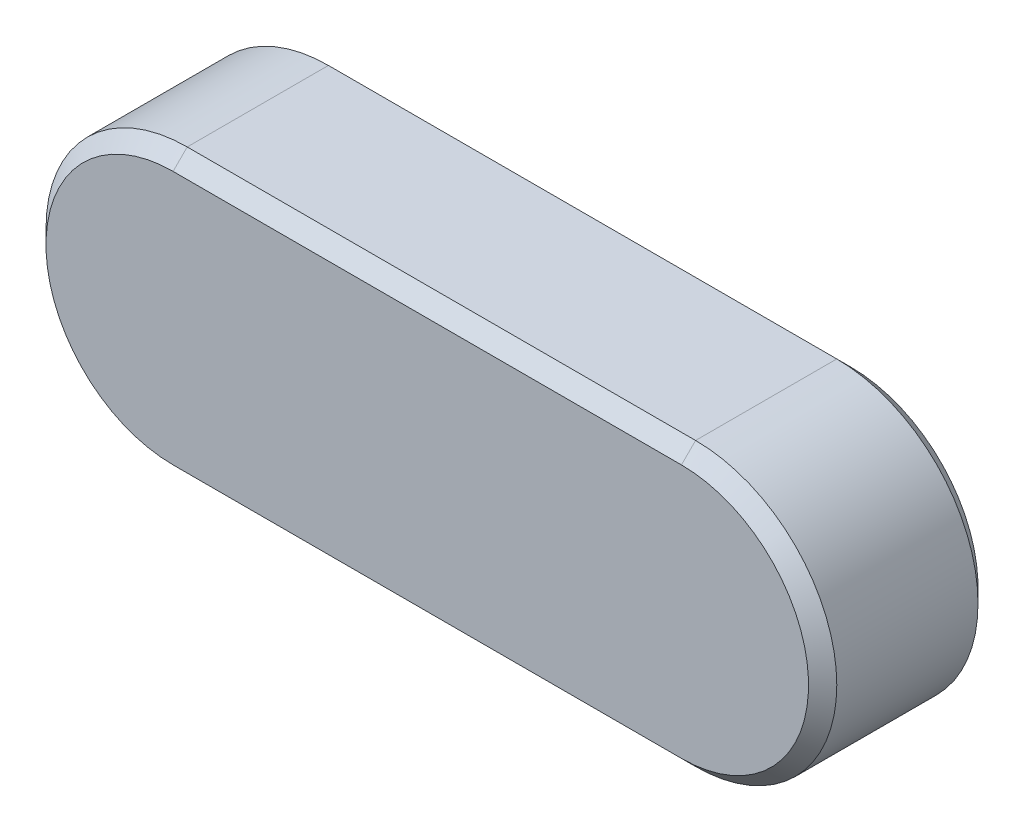
ISO-10303-21;
HEADER;
FILE_DESCRIPTION(('STEP AP214'),'2;1');
FILE_NAME('part.step','',(''),(''),'','','');
FILE_SCHEMA(('AUTOMOTIVE_DESIGN { 1 0 10303 214 1 1 1 1 }'));
ENDSEC;
DATA;
#1=APPLICATION_CONTEXT('core data for automotive mechanical design processes');
#2=APPLICATION_PROTOCOL_DEFINITION('international standard','automotive_design',2000,#1);
#3=PRODUCT_CONTEXT('',#1,'mechanical');
#4=PRODUCT('Part','Part','',(#3));
#5=PRODUCT_RELATED_PRODUCT_CATEGORY('part','',(#4));
#6=PRODUCT_DEFINITION_FORMATION('','',#4);
#7=PRODUCT_DEFINITION_CONTEXT('part definition',#1,'design');
#8=PRODUCT_DEFINITION('design','',#6,#7);
#9=PRODUCT_DEFINITION_SHAPE('','',#8);
#10=(LENGTH_UNIT() NAMED_UNIT(*) SI_UNIT(.MILLI.,.METRE.));
#11=(NAMED_UNIT(*) PLANE_ANGLE_UNIT() SI_UNIT($,.RADIAN.));
#12=(NAMED_UNIT(*) SI_UNIT($,.STERADIAN.) SOLID_ANGLE_UNIT());
#13=UNCERTAINTY_MEASURE_WITH_UNIT(LENGTH_MEASURE(1.E-05),#10,'distance_accuracy_value','');
#14=(GEOMETRIC_REPRESENTATION_CONTEXT(3) GLOBAL_UNCERTAINTY_ASSIGNED_CONTEXT((#13)) GLOBAL_UNIT_ASSIGNED_CONTEXT((#10,
#11,#12)) REPRESENTATION_CONTEXT('',''));
#15=CARTESIAN_POINT('',(0.,0.,0.));
#16=DIRECTION('',(0.,0.,1.));
#17=DIRECTION('',(1.,0.,0.));
#18=AXIS2_PLACEMENT_3D('',#15,#16,#17);
#19=CARTESIAN_POINT('',(0.,0.,3.));
#20=DIRECTION('',(0.,0.,-1.));
#21=DIRECTION('',(-1.,0.,0.));
#22=AXIS2_PLACEMENT_3D('',#19,#20,#21);
#23=CYLINDRICAL_SURFACE('',#22,2.5);
#24=DIRECTION('',(0.,0.,-1.));
#25=VECTOR('',#24,1.);
#26=CARTESIAN_POINT('',(0.,-2.5,3.));
#27=LINE('',#26,#25);
#28=CARTESIAN_POINT('',(0.,-2.5,2.75));
#29=VERTEX_POINT('',#28);
#30=CARTESIAN_POINT('',(0.,-2.5,0.250000000000002));
#31=VERTEX_POINT('',#30);
#32=EDGE_CURVE('E152',#29,#31,#27,.T.);
#33=ORIENTED_EDGE('',*,*,#32,.T.);
#34=CARTESIAN_POINT('',(0.,0.,0.250000000000002));
#35=DIRECTION('',(0.,0.,1.));
#36=DIRECTION('',(1.,0.,0.));
#37=AXIS2_PLACEMENT_3D('',#34,#35,#36);
#38=CIRCLE('',#37,2.5);
#39=CARTESIAN_POINT('',(0.,2.5,0.250000000000002));
#40=VERTEX_POINT('',#39);
#41=EDGE_CURVE('E176',#31,#40,#38,.T.);
#42=ORIENTED_EDGE('',*,*,#41,.T.);
#43=DIRECTION('',(0.,0.,-1.));
#44=VECTOR('',#43,1.);
#45=CARTESIAN_POINT('',(0.,2.5,3.));
#46=LINE('',#45,#44);
#47=CARTESIAN_POINT('',(0.,2.5,2.75));
#48=VERTEX_POINT('',#47);
#49=EDGE_CURVE('E121',#48,#40,#46,.T.);
#50=ORIENTED_EDGE('',*,*,#49,.F.);
#51=CARTESIAN_POINT('',(0.,0.,2.75));
#52=DIRECTION('',(0.,0.,1.));
#53=DIRECTION('',(1.,0.,0.));
#54=AXIS2_PLACEMENT_3D('',#51,#52,#53);
#55=CIRCLE('',#54,2.5);
#56=EDGE_CURVE('E174',#48,#29,#55,.F.);
#57=ORIENTED_EDGE('',*,*,#56,.T.);
#58=EDGE_LOOP('',(#33,#42,#50,#57));
#59=FACE_BOUND('',#58,.T.);
#60=ADVANCED_FACE('F30',(#59),#23,.T.);
#61=CARTESIAN_POINT('',(0.,2.5,3.));
#62=DIRECTION('',(0.,-1.,0.));
#63=DIRECTION('',(1.,0.,0.));
#64=AXIS2_PLACEMENT_3D('',#61,#62,#63);
#65=PLANE('',#64);
#66=ORIENTED_EDGE('',*,*,#49,.T.);
#67=DIRECTION('',(-1.,0.,0.));
#68=VECTOR('',#67,1.);
#69=CARTESIAN_POINT('',(0.,2.5,0.25));
#70=LINE('',#69,#68);
#71=CARTESIAN_POINT('',(-9.,2.5,0.250000000000002));
#72=VERTEX_POINT('',#71);
#73=EDGE_CURVE('E120',#40,#72,#70,.T.);
#74=ORIENTED_EDGE('',*,*,#73,.T.);
#75=DIRECTION('',(0.,0.,-1.));
#76=VECTOR('',#75,1.);
#77=CARTESIAN_POINT('',(-9.,2.5,3.));
#78=LINE('',#77,#76);
#79=CARTESIAN_POINT('',(-9.,2.5,2.75));
#80=VERTEX_POINT('',#79);
#81=EDGE_CURVE('E103',#80,#72,#78,.T.);
#82=ORIENTED_EDGE('',*,*,#81,.F.);
#83=DIRECTION('',(1.,0.,0.));
#84=VECTOR('',#83,1.);
#85=CARTESIAN_POINT('',(0.,2.5,2.75));
#86=LINE('',#85,#84);
#87=EDGE_CURVE('E117',#80,#48,#86,.T.);
#88=ORIENTED_EDGE('',*,*,#87,.T.);
#89=EDGE_LOOP('',(#66,#74,#82,#88));
#90=FACE_BOUND('',#89,.T.);
#91=ADVANCED_FACE('F116',(#90),#65,.F.);
#92=CARTESIAN_POINT('',(-9.,0.,3.));
#93=DIRECTION('',(0.,0.,-1.));
#94=DIRECTION('',(-1.,0.,0.));
#95=AXIS2_PLACEMENT_3D('',#92,#93,#94);
#96=CYLINDRICAL_SURFACE('',#95,2.5);
#97=ORIENTED_EDGE('',*,*,#81,.T.);
#98=CARTESIAN_POINT('',(-9.,0.,0.250000000000002));
#99=DIRECTION('',(0.,0.,1.));
#100=DIRECTION('',(1.,0.,0.));
#101=AXIS2_PLACEMENT_3D('',#98,#99,#100);
#102=CIRCLE('',#101,2.5);
#103=CARTESIAN_POINT('',(-9.,-2.5,0.250000000000002));
#104=VERTEX_POINT('',#103);
#105=EDGE_CURVE('E109',#72,#104,#102,.T.);
#106=ORIENTED_EDGE('',*,*,#105,.T.);
#107=DIRECTION('',(0.,0.,-1.));
#108=VECTOR('',#107,1.);
#109=CARTESIAN_POINT('',(-9.,-2.5,3.));
#110=LINE('',#109,#108);
#111=CARTESIAN_POINT('',(-9.,-2.5,2.75));
#112=VERTEX_POINT('',#111);
#113=EDGE_CURVE('E105',#112,#104,#110,.T.);
#114=ORIENTED_EDGE('',*,*,#113,.F.);
#115=CARTESIAN_POINT('',(-9.,0.,2.75));
#116=DIRECTION('',(0.,0.,1.));
#117=DIRECTION('',(1.,0.,0.));
#118=AXIS2_PLACEMENT_3D('',#115,#116,#117);
#119=CIRCLE('',#118,2.5);
#120=EDGE_CURVE('E100',#112,#80,#119,.F.);
#121=ORIENTED_EDGE('',*,*,#120,.T.);
#122=EDGE_LOOP('',(#97,#106,#114,#121));
#123=FACE_BOUND('',#122,.T.);
#124=ADVANCED_FACE('F102',(#123),#96,.T.);
#125=CARTESIAN_POINT('',(-9.,-2.5,3.));
#126=DIRECTION('',(0.,1.,0.));
#127=DIRECTION('',(0.,0.,1.));
#128=AXIS2_PLACEMENT_3D('',#125,#126,#127);
#129=PLANE('',#128);
#130=ORIENTED_EDGE('',*,*,#113,.T.);
#131=DIRECTION('',(1.,0.,0.));
#132=VECTOR('',#131,1.);
#133=CARTESIAN_POINT('',(-9.,-2.5,0.250000000000002));
#134=LINE('',#133,#132);
#135=EDGE_CURVE('E180',#104,#31,#134,.T.);
#136=ORIENTED_EDGE('',*,*,#135,.T.);
#137=ORIENTED_EDGE('',*,*,#32,.F.);
#138=DIRECTION('',(-1.,0.,0.));
#139=VECTOR('',#138,1.);
#140=CARTESIAN_POINT('',(-9.,-2.5,2.75));
#141=LINE('',#140,#139);
#142=EDGE_CURVE('E178',#29,#112,#141,.T.);
#143=ORIENTED_EDGE('',*,*,#142,.T.);
#144=EDGE_LOOP('',(#130,#136,#137,#143));
#145=FACE_BOUND('',#144,.T.);
#146=ADVANCED_FACE('F190',(#145),#129,.F.);
#147=CARTESIAN_POINT('',(0.,0.,3.));
#148=DIRECTION('',(0.,0.,1.));
#149=DIRECTION('',(1.,0.,0.));
#150=AXIS2_PLACEMENT_3D('',#147,#148,#149);
#151=PLANE('',#150);
#152=CARTESIAN_POINT('',(0.,0.,3.));
#153=DIRECTION('',(0.,0.,1.));
#154=DIRECTION('',(1.,0.,0.));
#155=AXIS2_PLACEMENT_3D('',#152,#153,#154);
#156=CIRCLE('',#155,2.25);
#157=CARTESIAN_POINT('',(0.,-2.25,3.));
#158=VERTEX_POINT('',#157);
#159=CARTESIAN_POINT('',(0.,2.25,3.));
#160=VERTEX_POINT('',#159);
#161=EDGE_CURVE('E54',#158,#160,#156,.T.);
#162=ORIENTED_EDGE('',*,*,#161,.T.);
#163=DIRECTION('',(-1.,0.,0.));
#164=VECTOR('',#163,1.);
#165=CARTESIAN_POINT('',(-9.,2.25,3.));
#166=LINE('',#165,#164);
#167=CARTESIAN_POINT('',(-9.,2.25,3.));
#168=VERTEX_POINT('',#167);
#169=EDGE_CURVE('E11',#160,#168,#166,.T.);
#170=ORIENTED_EDGE('',*,*,#169,.T.);
#171=CARTESIAN_POINT('',(-9.,0.,3.));
#172=DIRECTION('',(0.,0.,1.));
#173=DIRECTION('',(1.,0.,0.));
#174=AXIS2_PLACEMENT_3D('',#171,#172,#173);
#175=CIRCLE('',#174,2.25);
#176=CARTESIAN_POINT('',(-9.,-2.25,3.));
#177=VERTEX_POINT('',#176);
#178=EDGE_CURVE('E39',#168,#177,#175,.T.);
#179=ORIENTED_EDGE('',*,*,#178,.T.);
#180=DIRECTION('',(1.,0.,0.));
#181=VECTOR('',#180,1.);
#182=CARTESIAN_POINT('',(0.,-2.25,3.));
#183=LINE('',#182,#181);
#184=EDGE_CURVE('E182',#177,#158,#183,.T.);
#185=ORIENTED_EDGE('',*,*,#184,.T.);
#186=EDGE_LOOP('',(#162,#170,#179,#185));
#187=FACE_BOUND('',#186,.T.);
#188=ADVANCED_FACE('F185',(#187),#151,.T.);
#189=CARTESIAN_POINT('',(0.,0.,0.));
#190=DIRECTION('',(0.,0.,1.));
#191=DIRECTION('',(1.,0.,0.));
#192=AXIS2_PLACEMENT_3D('',#189,#190,#191);
#193=PLANE('',#192);
#194=CARTESIAN_POINT('',(-9.,0.,0.));
#195=DIRECTION('',(0.,0.,1.));
#196=DIRECTION('',(1.,0.,0.));
#197=AXIS2_PLACEMENT_3D('',#194,#195,#196);
#198=CIRCLE('',#197,2.25);
#199=CARTESIAN_POINT('',(-9.,-2.24999999999999,0.));
#200=VERTEX_POINT('',#199);
#201=CARTESIAN_POINT('',(-9.,2.25,0.));
#202=VERTEX_POINT('',#201);
#203=EDGE_CURVE('E169',#200,#202,#198,.F.);
#204=ORIENTED_EDGE('',*,*,#203,.T.);
#205=DIRECTION('',(1.,0.,0.));
#206=VECTOR('',#205,1.);
#207=CARTESIAN_POINT('',(0.,2.25,0.));
#208=LINE('',#207,#206);
#209=CARTESIAN_POINT('',(0.,2.25,0.));
#210=VERTEX_POINT('',#209);
#211=EDGE_CURVE('E110',#202,#210,#208,.T.);
#212=ORIENTED_EDGE('',*,*,#211,.T.);
#213=CARTESIAN_POINT('',(0.,0.,0.));
#214=DIRECTION('',(0.,0.,1.));
#215=DIRECTION('',(1.,0.,0.));
#216=AXIS2_PLACEMENT_3D('',#213,#214,#215);
#217=CIRCLE('',#216,2.25);
#218=CARTESIAN_POINT('',(0.,-2.24999999999999,0.));
#219=VERTEX_POINT('',#218);
#220=EDGE_CURVE('E167',#210,#219,#217,.F.);
#221=ORIENTED_EDGE('',*,*,#220,.T.);
#222=DIRECTION('',(-1.,0.,0.));
#223=VECTOR('',#222,1.);
#224=CARTESIAN_POINT('',(0.,-2.24999999999999,0.));
#225=LINE('',#224,#223);
#226=EDGE_CURVE('E165',#219,#200,#225,.T.);
#227=ORIENTED_EDGE('',*,*,#226,.T.);
#228=EDGE_LOOP('',(#204,#212,#221,#227));
#229=FACE_BOUND('',#228,.T.);
#230=ADVANCED_FACE('F217',(#229),#193,.F.);
#231=CARTESIAN_POINT('',(-9.,-2.5,0.250000000000002));
#232=DIRECTION('',(0.,0.707106781186545,0.70710678118655));
#233=DIRECTION('',(0.,-0.70710678118655,0.707106781186545));
#234=AXIS2_PLACEMENT_3D('',#231,#232,#233);
#235=PLANE('',#234);
#236=DIRECTION('',(0.,-0.70710678118655,0.707106781186545));
#237=VECTOR('',#236,1.);
#238=CARTESIAN_POINT('',(-9.,-2.24999999999999,0.));
#239=LINE('',#238,#237);
#240=EDGE_CURVE('E144',#200,#104,#239,.T.);
#241=ORIENTED_EDGE('',*,*,#240,.F.);
#242=ORIENTED_EDGE('',*,*,#226,.F.);
#243=DIRECTION('',(0.,0.70710678118655,-0.707106781186545));
#244=VECTOR('',#243,1.);
#245=CARTESIAN_POINT('',(0.,-2.5,0.250000000000002));
#246=LINE('',#245,#244);
#247=EDGE_CURVE('E132',#31,#219,#246,.T.);
#248=ORIENTED_EDGE('',*,*,#247,.F.);
#249=ORIENTED_EDGE('',*,*,#135,.F.);
#250=EDGE_LOOP('',(#241,#242,#248,#249));
#251=FACE_BOUND('',#250,.T.);
#252=ADVANCED_FACE('F193',(#251),#235,.F.);
#253=CARTESIAN_POINT('',(0.,0.,0.250000000000002));
#254=DIRECTION('',(0.,0.,1.));
#255=DIRECTION('',(1.,0.,0.));
#256=AXIS2_PLACEMENT_3D('',#253,#254,#255);
#257=CONICAL_SURFACE('',#256,2.5,0.785398163397452);
#258=ORIENTED_EDGE('',*,*,#247,.T.);
#259=ORIENTED_EDGE('',*,*,#220,.F.);
#260=DIRECTION('',(0.,-0.70710678118655,-0.707106781186545));
#261=VECTOR('',#260,1.);
#262=CARTESIAN_POINT('',(0.,2.5,0.250000000000002));
#263=LINE('',#262,#261);
#264=EDGE_CURVE('E138',#40,#210,#263,.T.);
#265=ORIENTED_EDGE('',*,*,#264,.F.);
#266=ORIENTED_EDGE('',*,*,#41,.F.);
#267=EDGE_LOOP('',(#258,#259,#265,#266));
#268=FACE_BOUND('',#267,.T.);
#269=ADVANCED_FACE('F196',(#268),#257,.T.);
#270=CARTESIAN_POINT('',(-9.,0.,0.250000000000002));
#271=DIRECTION('',(0.,0.,1.));
#272=DIRECTION('',(1.,0.,0.));
#273=AXIS2_PLACEMENT_3D('',#270,#271,#272);
#274=CONICAL_SURFACE('',#273,2.5,0.785398163397452);
#275=ORIENTED_EDGE('',*,*,#240,.T.);
#276=ORIENTED_EDGE('',*,*,#105,.F.);
#277=DIRECTION('',(0.,0.70710678118655,0.707106781186545));
#278=VECTOR('',#277,1.);
#279=CARTESIAN_POINT('',(-9.,2.25,0.));
#280=LINE('',#279,#278);
#281=EDGE_CURVE('E135',#202,#72,#280,.T.);
#282=ORIENTED_EDGE('',*,*,#281,.F.);
#283=ORIENTED_EDGE('',*,*,#203,.F.);
#284=EDGE_LOOP('',(#275,#276,#282,#283));
#285=FACE_BOUND('',#284,.T.);
#286=ADVANCED_FACE('F199',(#285),#274,.T.);
#287=CARTESIAN_POINT('',(0.,2.5,0.25));
#288=DIRECTION('',(0.,-0.707106781186545,0.70710678118655));
#289=DIRECTION('',(0.,-0.70710678118655,-0.707106781186545));
#290=AXIS2_PLACEMENT_3D('',#287,#288,#289);
#291=PLANE('',#290);
#292=ORIENTED_EDGE('',*,*,#264,.T.);
#293=ORIENTED_EDGE('',*,*,#211,.F.);
#294=ORIENTED_EDGE('',*,*,#281,.T.);
#295=ORIENTED_EDGE('',*,*,#73,.F.);
#296=EDGE_LOOP('',(#292,#293,#294,#295));
#297=FACE_BOUND('',#296,.T.);
#298=ADVANCED_FACE('F197',(#297),#291,.F.);
#299=CARTESIAN_POINT('',(0.,-2.25,3.));
#300=DIRECTION('',(0.,-0.70710678118655,0.707106781186545));
#301=DIRECTION('',(0.,-0.707106781186545,-0.70710678118655));
#302=AXIS2_PLACEMENT_3D('',#299,#300,#301);
#303=PLANE('',#302);
#304=DIRECTION('',(0.,0.707106781186545,0.70710678118655));
#305=VECTOR('',#304,1.);
#306=CARTESIAN_POINT('',(-9.,-2.5,2.75));
#307=LINE('',#306,#305);
#308=EDGE_CURVE('E129',#112,#177,#307,.T.);
#309=ORIENTED_EDGE('',*,*,#308,.F.);
#310=ORIENTED_EDGE('',*,*,#142,.F.);
#311=DIRECTION('',(0.,-0.707106781186545,-0.70710678118655));
#312=VECTOR('',#311,1.);
#313=CARTESIAN_POINT('',(0.,-2.25,3.));
#314=LINE('',#313,#312);
#315=EDGE_CURVE('E34',#158,#29,#314,.T.);
#316=ORIENTED_EDGE('',*,*,#315,.F.);
#317=ORIENTED_EDGE('',*,*,#184,.F.);
#318=EDGE_LOOP('',(#309,#310,#316,#317));
#319=FACE_BOUND('',#318,.T.);
#320=ADVANCED_FACE('F32',(#319),#303,.T.);
#321=CARTESIAN_POINT('',(0.,0.,3.));
#322=DIRECTION('',(0.,0.,-1.));
#323=DIRECTION('',(-1.,0.,0.));
#324=AXIS2_PLACEMENT_3D('',#321,#322,#323);
#325=CONICAL_SURFACE('',#324,2.25,0.785398163397445);
#326=ORIENTED_EDGE('',*,*,#315,.T.);
#327=ORIENTED_EDGE('',*,*,#56,.F.);
#328=DIRECTION('',(0.,0.707106781186545,-0.70710678118655));
#329=VECTOR('',#328,1.);
#330=CARTESIAN_POINT('',(0.,2.25,3.));
#331=LINE('',#330,#329);
#332=EDGE_CURVE('E124',#160,#48,#331,.T.);
#333=ORIENTED_EDGE('',*,*,#332,.F.);
#334=ORIENTED_EDGE('',*,*,#161,.F.);
#335=EDGE_LOOP('',(#326,#327,#333,#334));
#336=FACE_BOUND('',#335,.T.);
#337=ADVANCED_FACE('F188',(#336),#325,.T.);
#338=CARTESIAN_POINT('',(-9.,0.,3.));
#339=DIRECTION('',(0.,0.,-1.));
#340=DIRECTION('',(-1.,0.,0.));
#341=AXIS2_PLACEMENT_3D('',#338,#339,#340);
#342=CONICAL_SURFACE('',#341,2.25,0.785398163397445);
#343=ORIENTED_EDGE('',*,*,#308,.T.);
#344=ORIENTED_EDGE('',*,*,#178,.F.);
#345=DIRECTION('',(0.,-0.707106781186545,0.70710678118655));
#346=VECTOR('',#345,1.);
#347=CARTESIAN_POINT('',(-9.,2.5,2.75));
#348=LINE('',#347,#346);
#349=EDGE_CURVE('E47',#80,#168,#348,.T.);
#350=ORIENTED_EDGE('',*,*,#349,.F.);
#351=ORIENTED_EDGE('',*,*,#120,.F.);
#352=EDGE_LOOP('',(#343,#344,#350,#351));
#353=FACE_BOUND('',#352,.T.);
#354=ADVANCED_FACE('F127',(#353),#342,.T.);
#355=CARTESIAN_POINT('',(0.,2.25,3.));
#356=DIRECTION('',(0.,0.70710678118655,0.707106781186545));
#357=DIRECTION('',(0.,-0.707106781186545,0.70710678118655));
#358=AXIS2_PLACEMENT_3D('',#355,#356,#357);
#359=PLANE('',#358);
#360=ORIENTED_EDGE('',*,*,#332,.T.);
#361=ORIENTED_EDGE('',*,*,#87,.F.);
#362=ORIENTED_EDGE('',*,*,#349,.T.);
#363=ORIENTED_EDGE('',*,*,#169,.F.);
#364=EDGE_LOOP('',(#360,#361,#362,#363));
#365=FACE_BOUND('',#364,.T.);
#366=ADVANCED_FACE('F123',(#365),#359,.T.);
#367=CLOSED_SHELL('',(#60,#91,#124,#146,#188,#230,#252,#269,#286,#298,#320,#337,#354,#366));
#368=MANIFOLD_SOLID_BREP('B2',#367);
#369=ADVANCED_BREP_SHAPE_REPRESENTATION('',(#18,#368),#14);
#370=SHAPE_DEFINITION_REPRESENTATION(#9,#369);
ENDSEC;
END-ISO-10303-21;
